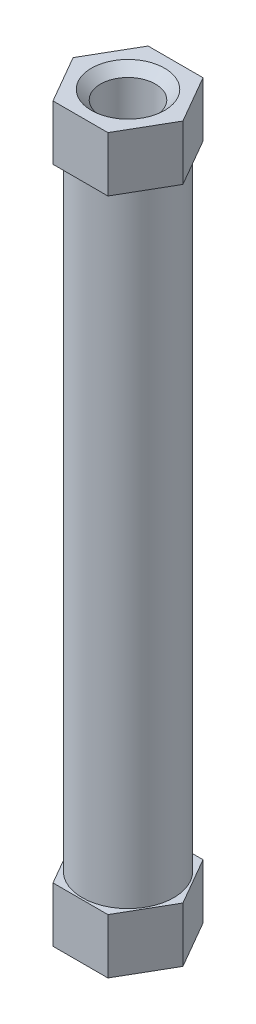
ISO-10303-21;
HEADER;
FILE_DESCRIPTION(('STEP AP214'),'2;1');
FILE_NAME('part.step','',(''),(''),'','','');
FILE_SCHEMA(('AUTOMOTIVE_DESIGN { 1 0 10303 214 1 1 1 1 }'));
ENDSEC;
DATA;
#1=APPLICATION_CONTEXT('core data for automotive mechanical design processes');
#2=APPLICATION_PROTOCOL_DEFINITION('international standard','automotive_design',2000,#1);
#3=PRODUCT_CONTEXT('',#1,'mechanical');
#4=PRODUCT('Part','Part','',(#3));
#5=PRODUCT_RELATED_PRODUCT_CATEGORY('part','',(#4));
#6=PRODUCT_DEFINITION_FORMATION('','',#4);
#7=PRODUCT_DEFINITION_CONTEXT('part definition',#1,'design');
#8=PRODUCT_DEFINITION('design','',#6,#7);
#9=PRODUCT_DEFINITION_SHAPE('','',#8);
#10=(LENGTH_UNIT() NAMED_UNIT(*) SI_UNIT(.MILLI.,.METRE.));
#11=(NAMED_UNIT(*) PLANE_ANGLE_UNIT() SI_UNIT($,.RADIAN.));
#12=(NAMED_UNIT(*) SI_UNIT($,.STERADIAN.) SOLID_ANGLE_UNIT());
#13=UNCERTAINTY_MEASURE_WITH_UNIT(LENGTH_MEASURE(1.E-05),#10,'distance_accuracy_value','');
#14=(GEOMETRIC_REPRESENTATION_CONTEXT(3) GLOBAL_UNCERTAINTY_ASSIGNED_CONTEXT((#13)) GLOBAL_UNIT_ASSIGNED_CONTEXT((#10,
#11,#12)) REPRESENTATION_CONTEXT('',''));
#15=CARTESIAN_POINT('',(0.,0.,0.));
#16=DIRECTION('',(0.,0.,1.));
#17=DIRECTION('',(1.,0.,0.));
#18=AXIS2_PLACEMENT_3D('',#15,#16,#17);
#19=CARTESIAN_POINT('',(-1.5,3.,2.59807621135332));
#20=DIRECTION('',(0.,0.,-1.));
#21=DIRECTION('',(-1.,0.,0.));
#22=AXIS2_PLACEMENT_3D('',#19,#20,#21);
#23=PLANE('',#22);
#24=DIRECTION('',(1.,0.,0.));
#25=VECTOR('',#24,1.);
#26=CARTESIAN_POINT('',(-1.5,0.,2.59807621135332));
#27=LINE('',#26,#25);
#28=CARTESIAN_POINT('',(-1.5,0.,2.59807621135332));
#29=VERTEX_POINT('',#28);
#30=CARTESIAN_POINT('',(1.5,0.,2.59807621135332));
#31=VERTEX_POINT('',#30);
#32=EDGE_CURVE('E143',#29,#31,#27,.T.);
#33=ORIENTED_EDGE('',*,*,#32,.T.);
#34=DIRECTION('',(0.,-1.,0.));
#35=VECTOR('',#34,1.);
#36=CARTESIAN_POINT('',(1.5,3.,2.59807621135332));
#37=LINE('',#36,#35);
#38=CARTESIAN_POINT('',(1.5,3.,2.59807621135332));
#39=VERTEX_POINT('',#38);
#40=EDGE_CURVE('E171',#39,#31,#37,.T.);
#41=ORIENTED_EDGE('',*,*,#40,.F.);
#42=DIRECTION('',(1.,0.,0.));
#43=VECTOR('',#42,1.);
#44=CARTESIAN_POINT('',(-1.5,3.,2.59807621135332));
#45=LINE('',#44,#43);
#46=CARTESIAN_POINT('',(-1.5,3.,2.59807621135332));
#47=VERTEX_POINT('',#46);
#48=EDGE_CURVE('E160',#47,#39,#45,.T.);
#49=ORIENTED_EDGE('',*,*,#48,.F.);
#50=DIRECTION('',(0.,-1.,0.));
#51=VECTOR('',#50,1.);
#52=CARTESIAN_POINT('',(-1.5,3.,2.59807621135332));
#53=LINE('',#52,#51);
#54=EDGE_CURVE('E139',#47,#29,#53,.T.);
#55=ORIENTED_EDGE('',*,*,#54,.T.);
#56=EDGE_LOOP('',(#33,#41,#49,#55));
#57=FACE_BOUND('',#56,.T.);
#58=ADVANCED_FACE('F47',(#57),#23,.F.);
#59=CARTESIAN_POINT('',(1.5,3.,2.59807621135332));
#60=DIRECTION('',(-0.866025403784439,0.,-0.5));
#61=DIRECTION('',(-0.5,0.,0.866025403784439));
#62=AXIS2_PLACEMENT_3D('',#59,#60,#61);
#63=PLANE('',#62);
#64=DIRECTION('',(0.5,0.,-0.866025403784439));
#65=VECTOR('',#64,1.);
#66=CARTESIAN_POINT('',(1.5,0.,2.59807621135332));
#67=LINE('',#66,#65);
#68=CARTESIAN_POINT('',(3.,0.,0.));
#69=VERTEX_POINT('',#68);
#70=EDGE_CURVE('E147',#31,#69,#67,.T.);
#71=ORIENTED_EDGE('',*,*,#70,.T.);
#72=DIRECTION('',(0.,-1.,0.));
#73=VECTOR('',#72,1.);
#74=CARTESIAN_POINT('',(3.,3.,0.));
#75=LINE('',#74,#73);
#76=CARTESIAN_POINT('',(3.,3.,0.));
#77=VERTEX_POINT('',#76);
#78=EDGE_CURVE('E167',#77,#69,#75,.T.);
#79=ORIENTED_EDGE('',*,*,#78,.F.);
#80=DIRECTION('',(0.5,0.,-0.866025403784439));
#81=VECTOR('',#80,1.);
#82=CARTESIAN_POINT('',(1.5,3.,2.59807621135332));
#83=LINE('',#82,#81);
#84=EDGE_CURVE('E105',#39,#77,#83,.T.);
#85=ORIENTED_EDGE('',*,*,#84,.F.);
#86=ORIENTED_EDGE('',*,*,#40,.T.);
#87=EDGE_LOOP('',(#71,#79,#85,#86));
#88=FACE_BOUND('',#87,.T.);
#89=ADVANCED_FACE('F215',(#88),#63,.F.);
#90=CARTESIAN_POINT('',(3.,3.,0.));
#91=DIRECTION('',(-0.866025403784438,0.,0.5));
#92=DIRECTION('',(0.5,0.,0.866025403784439));
#93=AXIS2_PLACEMENT_3D('',#90,#91,#92);
#94=PLANE('',#93);
#95=DIRECTION('',(-0.5,0.,-0.866025403784439));
#96=VECTOR('',#95,1.);
#97=CARTESIAN_POINT('',(3.,0.,0.));
#98=LINE('',#97,#96);
#99=CARTESIAN_POINT('',(1.5,0.,-2.59807621135332));
#100=VERTEX_POINT('',#99);
#101=EDGE_CURVE('E151',#69,#100,#98,.T.);
#102=ORIENTED_EDGE('',*,*,#101,.T.);
#103=DIRECTION('',(0.,-1.,0.));
#104=VECTOR('',#103,1.);
#105=CARTESIAN_POINT('',(1.5,3.,-2.59807621135332));
#106=LINE('',#105,#104);
#107=CARTESIAN_POINT('',(1.5,3.,-2.59807621135332));
#108=VERTEX_POINT('',#107);
#109=EDGE_CURVE('E132',#108,#100,#106,.T.);
#110=ORIENTED_EDGE('',*,*,#109,.F.);
#111=DIRECTION('',(-0.5,0.,-0.866025403784439));
#112=VECTOR('',#111,1.);
#113=CARTESIAN_POINT('',(3.,3.,0.));
#114=LINE('',#113,#112);
#115=EDGE_CURVE('E121',#77,#108,#114,.T.);
#116=ORIENTED_EDGE('',*,*,#115,.F.);
#117=ORIENTED_EDGE('',*,*,#78,.T.);
#118=EDGE_LOOP('',(#102,#110,#116,#117));
#119=FACE_BOUND('',#118,.T.);
#120=ADVANCED_FACE('F220',(#119),#94,.F.);
#121=CARTESIAN_POINT('',(1.5,3.,-2.59807621135332));
#122=DIRECTION('',(0.,0.,1.));
#123=DIRECTION('',(1.,0.,0.));
#124=AXIS2_PLACEMENT_3D('',#121,#122,#123);
#125=PLANE('',#124);
#126=DIRECTION('',(-1.,0.,0.));
#127=VECTOR('',#126,1.);
#128=CARTESIAN_POINT('',(1.5,0.,-2.59807621135332));
#129=LINE('',#128,#127);
#130=CARTESIAN_POINT('',(-1.5,0.,-2.59807621135332));
#131=VERTEX_POINT('',#130);
#132=EDGE_CURVE('E130',#100,#131,#129,.T.);
#133=ORIENTED_EDGE('',*,*,#132,.T.);
#134=DIRECTION('',(0.,-1.,0.));
#135=VECTOR('',#134,1.);
#136=CARTESIAN_POINT('',(-1.5,3.,-2.59807621135332));
#137=LINE('',#136,#135);
#138=CARTESIAN_POINT('',(-1.5,3.,-2.59807621135332));
#139=VERTEX_POINT('',#138);
#140=EDGE_CURVE('E127',#139,#131,#137,.T.);
#141=ORIENTED_EDGE('',*,*,#140,.F.);
#142=DIRECTION('',(-1.,0.,0.));
#143=VECTOR('',#142,1.);
#144=CARTESIAN_POINT('',(1.5,3.,-2.59807621135332));
#145=LINE('',#144,#143);
#146=EDGE_CURVE('E115',#108,#139,#145,.T.);
#147=ORIENTED_EDGE('',*,*,#146,.F.);
#148=ORIENTED_EDGE('',*,*,#109,.T.);
#149=EDGE_LOOP('',(#133,#141,#147,#148));
#150=FACE_BOUND('',#149,.T.);
#151=ADVANCED_FACE('F128',(#150),#125,.F.);
#152=CARTESIAN_POINT('',(-1.5,3.,-2.59807621135332));
#153=DIRECTION('',(0.866025403784439,0.,0.5));
#154=DIRECTION('',(0.5,0.,-0.866025403784439));
#155=AXIS2_PLACEMENT_3D('',#152,#153,#154);
#156=PLANE('',#155);
#157=DIRECTION('',(-0.5,0.,0.866025403784439));
#158=VECTOR('',#157,1.);
#159=CARTESIAN_POINT('',(-1.5,0.,-2.59807621135332));
#160=LINE('',#159,#158);
#161=CARTESIAN_POINT('',(-3.,0.,0.));
#162=VERTEX_POINT('',#161);
#163=EDGE_CURVE('E90',#131,#162,#160,.T.);
#164=ORIENTED_EDGE('',*,*,#163,.T.);
#165=DIRECTION('',(0.,-1.,0.));
#166=VECTOR('',#165,1.);
#167=CARTESIAN_POINT('',(-3.,3.,0.));
#168=LINE('',#167,#166);
#169=CARTESIAN_POINT('',(-3.,3.,0.));
#170=VERTEX_POINT('',#169);
#171=EDGE_CURVE('E133',#170,#162,#168,.T.);
#172=ORIENTED_EDGE('',*,*,#171,.F.);
#173=DIRECTION('',(-0.5,0.,0.866025403784439));
#174=VECTOR('',#173,1.);
#175=CARTESIAN_POINT('',(-1.5,3.,-2.59807621135332));
#176=LINE('',#175,#174);
#177=EDGE_CURVE('E119',#139,#170,#176,.T.);
#178=ORIENTED_EDGE('',*,*,#177,.F.);
#179=ORIENTED_EDGE('',*,*,#140,.T.);
#180=EDGE_LOOP('',(#164,#172,#178,#179));
#181=FACE_BOUND('',#180,.T.);
#182=ADVANCED_FACE('F135',(#181),#156,.F.);
#183=CARTESIAN_POINT('',(-3.,3.,0.));
#184=DIRECTION('',(0.866025403784438,0.,-0.500000000000001));
#185=DIRECTION('',(-0.500000000000001,0.,-0.866025403784438));
#186=AXIS2_PLACEMENT_3D('',#183,#184,#185);
#187=PLANE('',#186);
#188=DIRECTION('',(0.500000000000001,0.,0.866025403784438));
#189=VECTOR('',#188,1.);
#190=CARTESIAN_POINT('',(-3.,0.,0.));
#191=LINE('',#190,#189);
#192=EDGE_CURVE('E96',#162,#29,#191,.T.);
#193=ORIENTED_EDGE('',*,*,#192,.T.);
#194=ORIENTED_EDGE('',*,*,#54,.F.);
#195=DIRECTION('',(0.500000000000001,0.,0.866025403784438));
#196=VECTOR('',#195,1.);
#197=CARTESIAN_POINT('',(-3.,3.,0.));
#198=LINE('',#197,#196);
#199=EDGE_CURVE('E66',#170,#47,#198,.T.);
#200=ORIENTED_EDGE('',*,*,#199,.F.);
#201=ORIENTED_EDGE('',*,*,#171,.T.);
#202=EDGE_LOOP('',(#193,#194,#200,#201));
#203=FACE_BOUND('',#202,.T.);
#204=ADVANCED_FACE('F204',(#203),#187,.F.);
#205=CARTESIAN_POINT('',(0.,3.,0.));
#206=DIRECTION('',(0.,1.,0.));
#207=DIRECTION('',(0.,0.,1.));
#208=AXIS2_PLACEMENT_3D('',#205,#206,#207);
#209=PLANE('',#208);
#210=CARTESIAN_POINT('',(0.,3.,0.));
#211=DIRECTION('',(0.,1.,0.));
#212=DIRECTION('',(0.,0.,1.));
#213=AXIS2_PLACEMENT_3D('',#210,#211,#212);
#214=CIRCLE('',#213,2.5);
#215=CARTESIAN_POINT('',(0.,3.,2.5));
#216=VERTEX_POINT('',#215);
#217=EDGE_CURVE('E174',#216,#216,#214,.T.);
#218=ORIENTED_EDGE('',*,*,#217,.F.);
#219=EDGE_LOOP('',(#218));
#220=FACE_BOUND('',#219,.T.);
#221=ORIENTED_EDGE('',*,*,#48,.T.);
#222=ORIENTED_EDGE('',*,*,#84,.T.);
#223=ORIENTED_EDGE('',*,*,#115,.T.);
#224=ORIENTED_EDGE('',*,*,#146,.T.);
#225=ORIENTED_EDGE('',*,*,#177,.T.);
#226=ORIENTED_EDGE('',*,*,#199,.T.);
#227=EDGE_LOOP('',(#221,#222,#223,#224,#225,#226));
#228=FACE_BOUND('',#227,.T.);
#229=ADVANCED_FACE('F117',(#220,#228),#209,.T.);
#230=CARTESIAN_POINT('',(0.,0.,0.));
#231=DIRECTION('',(0.,1.,0.));
#232=DIRECTION('',(0.,0.,1.));
#233=AXIS2_PLACEMENT_3D('',#230,#231,#232);
#234=PLANE('',#233);
#235=CARTESIAN_POINT('',(0.,0.,0.));
#236=DIRECTION('',(0.,1.,0.));
#237=DIRECTION('',(0.,0.,1.));
#238=AXIS2_PLACEMENT_3D('',#235,#236,#237);
#239=CIRCLE('',#238,2.);
#240=CARTESIAN_POINT('',(0.,0.,2.));
#241=VERTEX_POINT('',#240);
#242=EDGE_CURVE('E175',#241,#241,#239,.T.);
#243=ORIENTED_EDGE('',*,*,#242,.T.);
#244=EDGE_LOOP('',(#243));
#245=FACE_BOUND('',#244,.T.);
#246=ORIENTED_EDGE('',*,*,#32,.F.);
#247=ORIENTED_EDGE('',*,*,#192,.F.);
#248=ORIENTED_EDGE('',*,*,#163,.F.);
#249=ORIENTED_EDGE('',*,*,#132,.F.);
#250=ORIENTED_EDGE('',*,*,#101,.F.);
#251=ORIENTED_EDGE('',*,*,#70,.F.);
#252=EDGE_LOOP('',(#246,#247,#248,#249,#250,#251));
#253=FACE_BOUND('',#252,.T.);
#254=ADVANCED_FACE('F194',(#245,#253),#234,.F.);
#255=CARTESIAN_POINT('',(0.,37.,0.));
#256=DIRECTION('',(0.,-1.,0.));
#257=DIRECTION('',(0.,0.,-1.));
#258=AXIS2_PLACEMENT_3D('',#255,#256,#257);
#259=CYLINDRICAL_SURFACE('',#258,2.5);
#260=CARTESIAN_POINT('',(0.,37.,0.));
#261=DIRECTION('',(0.,1.,0.));
#262=DIRECTION('',(0.,0.,1.));
#263=AXIS2_PLACEMENT_3D('',#260,#261,#262);
#264=CIRCLE('',#263,2.5);
#265=CARTESIAN_POINT('',(0.,37.,2.5));
#266=VERTEX_POINT('',#265);
#267=EDGE_CURVE('E148',#266,#266,#264,.T.);
#268=ORIENTED_EDGE('',*,*,#267,.F.);
#269=EDGE_LOOP('',(#268));
#270=FACE_BOUND('',#269,.T.);
#271=ORIENTED_EDGE('',*,*,#217,.T.);
#272=EDGE_LOOP('',(#271));
#273=FACE_BOUND('',#272,.T.);
#274=ADVANCED_FACE('F197',(#270,#273),#259,.T.);
#275=CARTESIAN_POINT('',(-1.5,40.,2.59807621135332));
#276=DIRECTION('',(0.,0.,-1.));
#277=DIRECTION('',(-1.,0.,0.));
#278=AXIS2_PLACEMENT_3D('',#275,#276,#277);
#279=PLANE('',#278);
#280=DIRECTION('',(1.,0.,0.));
#281=VECTOR('',#280,1.);
#282=CARTESIAN_POINT('',(-1.5,37.,2.59807621135332));
#283=LINE('',#282,#281);
#284=CARTESIAN_POINT('',(-1.5,37.,2.59807621135332));
#285=VERTEX_POINT('',#284);
#286=CARTESIAN_POINT('',(1.5,37.,2.59807621135332));
#287=VERTEX_POINT('',#286);
#288=EDGE_CURVE('E402',#285,#287,#283,.T.);
#289=ORIENTED_EDGE('',*,*,#288,.T.);
#290=DIRECTION('',(0.,-1.,0.));
#291=VECTOR('',#290,1.);
#292=CARTESIAN_POINT('',(1.5,40.,2.59807621135332));
#293=LINE('',#292,#291);
#294=CARTESIAN_POINT('',(1.5,40.,2.59807621135332));
#295=VERTEX_POINT('',#294);
#296=EDGE_CURVE('E399',#295,#287,#293,.T.);
#297=ORIENTED_EDGE('',*,*,#296,.F.);
#298=DIRECTION('',(1.,0.,0.));
#299=VECTOR('',#298,1.);
#300=CARTESIAN_POINT('',(-1.5,40.,2.59807621135332));
#301=LINE('',#300,#299);
#302=CARTESIAN_POINT('',(-1.5,40.,2.59807621135332));
#303=VERTEX_POINT('',#302);
#304=EDGE_CURVE('E381',#303,#295,#301,.T.);
#305=ORIENTED_EDGE('',*,*,#304,.F.);
#306=DIRECTION('',(0.,-1.,0.));
#307=VECTOR('',#306,1.);
#308=CARTESIAN_POINT('',(-1.5,40.,2.59807621135332));
#309=LINE('',#308,#307);
#310=EDGE_CURVE('E436',#303,#285,#309,.T.);
#311=ORIENTED_EDGE('',*,*,#310,.T.);
#312=EDGE_LOOP('',(#289,#297,#305,#311));
#313=FACE_BOUND('',#312,.T.);
#314=ADVANCED_FACE('F269',(#313),#279,.F.);
#315=CARTESIAN_POINT('',(1.5,40.,2.59807621135332));
#316=DIRECTION('',(-0.866025403784439,0.,-0.5));
#317=DIRECTION('',(-0.5,0.,0.866025403784439));
#318=AXIS2_PLACEMENT_3D('',#315,#316,#317);
#319=PLANE('',#318);
#320=DIRECTION('',(0.5,0.,-0.866025403784439));
#321=VECTOR('',#320,1.);
#322=CARTESIAN_POINT('',(1.5,37.,2.59807621135332));
#323=LINE('',#322,#321);
#324=CARTESIAN_POINT('',(3.,37.,0.));
#325=VERTEX_POINT('',#324);
#326=EDGE_CURVE('E454',#287,#325,#323,.T.);
#327=ORIENTED_EDGE('',*,*,#326,.T.);
#328=DIRECTION('',(0.,-1.,0.));
#329=VECTOR('',#328,1.);
#330=CARTESIAN_POINT('',(3.,40.,0.));
#331=LINE('',#330,#329);
#332=CARTESIAN_POINT('',(3.,40.,0.));
#333=VERTEX_POINT('',#332);
#334=EDGE_CURVE('E405',#333,#325,#331,.T.);
#335=ORIENTED_EDGE('',*,*,#334,.F.);
#336=DIRECTION('',(0.5,0.,-0.866025403784439));
#337=VECTOR('',#336,1.);
#338=CARTESIAN_POINT('',(1.5,40.,2.59807621135332));
#339=LINE('',#338,#337);
#340=EDGE_CURVE('E386',#295,#333,#339,.T.);
#341=ORIENTED_EDGE('',*,*,#340,.F.);
#342=ORIENTED_EDGE('',*,*,#296,.T.);
#343=EDGE_LOOP('',(#327,#335,#341,#342));
#344=FACE_BOUND('',#343,.T.);
#345=ADVANCED_FACE('F279',(#344),#319,.F.);
#346=CARTESIAN_POINT('',(3.,40.,0.));
#347=DIRECTION('',(-0.866025403784438,0.,0.5));
#348=DIRECTION('',(0.5,0.,0.866025403784438));
#349=AXIS2_PLACEMENT_3D('',#346,#347,#348);
#350=PLANE('',#349);
#351=DIRECTION('',(-0.5,0.,-0.866025403784438));
#352=VECTOR('',#351,1.);
#353=CARTESIAN_POINT('',(3.,37.,0.));
#354=LINE('',#353,#352);
#355=CARTESIAN_POINT('',(1.5,37.,-2.59807621135332));
#356=VERTEX_POINT('',#355);
#357=EDGE_CURVE('E450',#325,#356,#354,.T.);
#358=ORIENTED_EDGE('',*,*,#357,.T.);
#359=DIRECTION('',(0.,-1.,0.));
#360=VECTOR('',#359,1.);
#361=CARTESIAN_POINT('',(1.5,40.,-2.59807621135332));
#362=LINE('',#361,#360);
#363=CARTESIAN_POINT('',(1.5,40.,-2.59807621135332));
#364=VERTEX_POINT('',#363);
#365=EDGE_CURVE('E412',#364,#356,#362,.T.);
#366=ORIENTED_EDGE('',*,*,#365,.F.);
#367=DIRECTION('',(-0.5,0.,-0.866025403784438));
#368=VECTOR('',#367,1.);
#369=CARTESIAN_POINT('',(3.,40.,0.));
#370=LINE('',#369,#368);
#371=EDGE_CURVE('E468',#333,#364,#370,.T.);
#372=ORIENTED_EDGE('',*,*,#371,.F.);
#373=ORIENTED_EDGE('',*,*,#334,.T.);
#374=EDGE_LOOP('',(#358,#366,#372,#373));
#375=FACE_BOUND('',#374,.T.);
#376=ADVANCED_FACE('F289',(#375),#350,.F.);
#377=CARTESIAN_POINT('',(1.5,40.,-2.59807621135332));
#378=DIRECTION('',(0.,0.,1.));
#379=DIRECTION('',(1.,0.,0.));
#380=AXIS2_PLACEMENT_3D('',#377,#378,#379);
#381=PLANE('',#380);
#382=DIRECTION('',(-1.,0.,0.));
#383=VECTOR('',#382,1.);
#384=CARTESIAN_POINT('',(1.5,37.,-2.59807621135332));
#385=LINE('',#384,#383);
#386=CARTESIAN_POINT('',(-1.5,37.,-2.59807621135332));
#387=VERTEX_POINT('',#386);
#388=EDGE_CURVE('E446',#356,#387,#385,.T.);
#389=ORIENTED_EDGE('',*,*,#388,.T.);
#390=DIRECTION('',(0.,-1.,0.));
#391=VECTOR('',#390,1.);
#392=CARTESIAN_POINT('',(-1.5,40.,-2.59807621135332));
#393=LINE('',#392,#391);
#394=CARTESIAN_POINT('',(-1.5,40.,-2.59807621135332));
#395=VERTEX_POINT('',#394);
#396=EDGE_CURVE('E428',#395,#387,#393,.T.);
#397=ORIENTED_EDGE('',*,*,#396,.F.);
#398=DIRECTION('',(-1.,0.,0.));
#399=VECTOR('',#398,1.);
#400=CARTESIAN_POINT('',(1.5,40.,-2.59807621135332));
#401=LINE('',#400,#399);
#402=EDGE_CURVE('E464',#364,#395,#401,.T.);
#403=ORIENTED_EDGE('',*,*,#402,.F.);
#404=ORIENTED_EDGE('',*,*,#365,.T.);
#405=EDGE_LOOP('',(#389,#397,#403,#404));
#406=FACE_BOUND('',#405,.T.);
#407=ADVANCED_FACE('F299',(#406),#381,.F.);
#408=CARTESIAN_POINT('',(-1.5,40.,-2.59807621135332));
#409=DIRECTION('',(0.866025403784439,0.,0.5));
#410=DIRECTION('',(0.5,0.,-0.866025403784439));
#411=AXIS2_PLACEMENT_3D('',#408,#409,#410);
#412=PLANE('',#411);
#413=DIRECTION('',(-0.5,0.,0.866025403784439));
#414=VECTOR('',#413,1.);
#415=CARTESIAN_POINT('',(-1.5,37.,-2.59807621135332));
#416=LINE('',#415,#414);
#417=CARTESIAN_POINT('',(-3.00000000000001,37.,0.));
#418=VERTEX_POINT('',#417);
#419=EDGE_CURVE('E442',#387,#418,#416,.T.);
#420=ORIENTED_EDGE('',*,*,#419,.T.);
#421=DIRECTION('',(0.,-1.,0.));
#422=VECTOR('',#421,1.);
#423=CARTESIAN_POINT('',(-3.00000000000001,40.,0.));
#424=LINE('',#423,#422);
#425=CARTESIAN_POINT('',(-3.00000000000001,40.,0.));
#426=VERTEX_POINT('',#425);
#427=EDGE_CURVE('E432',#426,#418,#424,.T.);
#428=ORIENTED_EDGE('',*,*,#427,.F.);
#429=DIRECTION('',(-0.5,0.,0.866025403784439));
#430=VECTOR('',#429,1.);
#431=CARTESIAN_POINT('',(-1.5,40.,-2.59807621135332));
#432=LINE('',#431,#430);
#433=EDGE_CURVE('E461',#395,#426,#432,.T.);
#434=ORIENTED_EDGE('',*,*,#433,.F.);
#435=ORIENTED_EDGE('',*,*,#396,.T.);
#436=EDGE_LOOP('',(#420,#428,#434,#435));
#437=FACE_BOUND('',#436,.T.);
#438=ADVANCED_FACE('F309',(#437),#412,.F.);
#439=CARTESIAN_POINT('',(-3.00000000000001,40.,0.));
#440=DIRECTION('',(0.866025403784438,0.,-0.5));
#441=DIRECTION('',(-0.5,0.,-0.866025403784439));
#442=AXIS2_PLACEMENT_3D('',#439,#440,#441);
#443=PLANE('',#442);
#444=DIRECTION('',(0.5,0.,0.866025403784439));
#445=VECTOR('',#444,1.);
#446=CARTESIAN_POINT('',(-3.00000000000001,37.,0.));
#447=LINE('',#446,#445);
#448=EDGE_CURVE('E395',#418,#285,#447,.T.);
#449=ORIENTED_EDGE('',*,*,#448,.T.);
#450=ORIENTED_EDGE('',*,*,#310,.F.);
#451=DIRECTION('',(0.5,0.,0.866025403784439));
#452=VECTOR('',#451,1.);
#453=CARTESIAN_POINT('',(-3.00000000000001,40.,0.));
#454=LINE('',#453,#452);
#455=EDGE_CURVE('E390',#426,#303,#454,.T.);
#456=ORIENTED_EDGE('',*,*,#455,.F.);
#457=ORIENTED_EDGE('',*,*,#427,.T.);
#458=EDGE_LOOP('',(#449,#450,#456,#457));
#459=FACE_BOUND('',#458,.T.);
#460=ADVANCED_FACE('F319',(#459),#443,.F.);
#461=CARTESIAN_POINT('',(0.,40.,0.));
#462=DIRECTION('',(0.,1.,0.));
#463=DIRECTION('',(0.,0.,1.));
#464=AXIS2_PLACEMENT_3D('',#461,#462,#463);
#465=PLANE('',#464);
#466=CARTESIAN_POINT('',(0.,40.,0.));
#467=DIRECTION('',(0.,1.,0.));
#468=DIRECTION('',(0.,0.,1.));
#469=AXIS2_PLACEMENT_3D('',#466,#467,#468);
#470=CIRCLE('',#469,1.99999999999999);
#471=CARTESIAN_POINT('',(0.,40.,1.99999999999999));
#472=VERTEX_POINT('',#471);
#473=EDGE_CURVE('E11',#472,#472,#470,.F.);
#474=ORIENTED_EDGE('',*,*,#473,.T.);
#475=EDGE_LOOP('',(#474));
#476=FACE_BOUND('',#475,.T.);
#477=ORIENTED_EDGE('',*,*,#304,.T.);
#478=ORIENTED_EDGE('',*,*,#340,.T.);
#479=ORIENTED_EDGE('',*,*,#371,.T.);
#480=ORIENTED_EDGE('',*,*,#402,.T.);
#481=ORIENTED_EDGE('',*,*,#433,.T.);
#482=ORIENTED_EDGE('',*,*,#455,.T.);
#483=EDGE_LOOP('',(#477,#478,#479,#480,#481,#482));
#484=FACE_BOUND('',#483,.T.);
#485=ADVANCED_FACE('F329',(#476,#484),#465,.T.);
#486=CARTESIAN_POINT('',(0.,37.,0.));
#487=DIRECTION('',(0.,1.,0.));
#488=DIRECTION('',(0.,0.,1.));
#489=AXIS2_PLACEMENT_3D('',#486,#487,#488);
#490=PLANE('',#489);
#491=ORIENTED_EDGE('',*,*,#267,.T.);
#492=EDGE_LOOP('',(#491));
#493=FACE_BOUND('',#492,.T.);
#494=ORIENTED_EDGE('',*,*,#288,.F.);
#495=ORIENTED_EDGE('',*,*,#448,.F.);
#496=ORIENTED_EDGE('',*,*,#419,.F.);
#497=ORIENTED_EDGE('',*,*,#388,.F.);
#498=ORIENTED_EDGE('',*,*,#357,.F.);
#499=ORIENTED_EDGE('',*,*,#326,.F.);
#500=EDGE_LOOP('',(#494,#495,#496,#497,#498,#499));
#501=FACE_BOUND('',#500,.T.);
#502=ADVANCED_FACE('F338',(#493,#501),#490,.F.);
#503=CARTESIAN_POINT('',(0.,0.,0.));
#504=DIRECTION('',(0.,1.,0.));
#505=DIRECTION('',(0.,0.,1.));
#506=AXIS2_PLACEMENT_3D('',#503,#504,#505);
#507=CYLINDRICAL_SURFACE('',#506,1.5);
#508=CARTESIAN_POINT('',(0.,0.500000000000007,0.));
#509=DIRECTION('',(0.,1.,0.));
#510=DIRECTION('',(0.,0.,1.));
#511=AXIS2_PLACEMENT_3D('',#508,#509,#510);
#512=CIRCLE('',#511,1.5);
#513=CARTESIAN_POINT('',(0.,0.500000000000007,1.5));
#514=VERTEX_POINT('',#513);
#515=EDGE_CURVE('E58',#514,#514,#512,.F.);
#516=ORIENTED_EDGE('',*,*,#515,.T.);
#517=EDGE_LOOP('',(#516));
#518=FACE_BOUND('',#517,.T.);
#519=CARTESIAN_POINT('',(0.,39.5,0.));
#520=DIRECTION('',(0.,1.,0.));
#521=DIRECTION('',(0.,0.,1.));
#522=AXIS2_PLACEMENT_3D('',#519,#520,#521);
#523=CIRCLE('',#522,1.5);
#524=CARTESIAN_POINT('',(0.,39.5,1.5));
#525=VERTEX_POINT('',#524);
#526=EDGE_CURVE('E179',#525,#525,#523,.T.);
#527=ORIENTED_EDGE('',*,*,#526,.T.);
#528=EDGE_LOOP('',(#527));
#529=FACE_BOUND('',#528,.T.);
#530=ADVANCED_FACE('F186',(#518,#529),#507,.F.);
#531=CARTESIAN_POINT('',(0.,0.,0.));
#532=DIRECTION('',(0.,-1.,0.));
#533=DIRECTION('',(0.,0.,-1.));
#534=AXIS2_PLACEMENT_3D('',#531,#532,#533);
#535=CONICAL_SURFACE('',#534,2.,0.785398163397443);
#536=ORIENTED_EDGE('',*,*,#515,.F.);
#537=EDGE_LOOP('',(#536));
#538=FACE_BOUND('',#537,.T.);
#539=ORIENTED_EDGE('',*,*,#242,.F.);
#540=EDGE_LOOP('',(#539));
#541=FACE_BOUND('',#540,.T.);
#542=ADVANCED_FACE('F189',(#538,#541),#535,.F.);
#543=CARTESIAN_POINT('',(0.,39.5,0.));
#544=DIRECTION('',(0.,1.,0.));
#545=DIRECTION('',(0.,0.,1.));
#546=AXIS2_PLACEMENT_3D('',#543,#544,#545);
#547=CONICAL_SURFACE('',#546,1.5,0.785398163397449);
#548=ORIENTED_EDGE('',*,*,#473,.F.);
#549=EDGE_LOOP('',(#548));
#550=FACE_BOUND('',#549,.T.);
#551=ORIENTED_EDGE('',*,*,#526,.F.);
#552=EDGE_LOOP('',(#551));
#553=FACE_BOUND('',#552,.T.);
#554=ADVANCED_FACE('F50',(#550,#553),#547,.F.);
#555=CLOSED_SHELL('',(#58,#89,#120,#151,#182,#204,#229,#254,#274,#314,#345,#376,#407,#438,#460,
#485,#502,#530,#542,#554));
#556=MANIFOLD_SOLID_BREP('B2',#555);
#557=ADVANCED_BREP_SHAPE_REPRESENTATION('',(#18,#556),#14);
#558=SHAPE_DEFINITION_REPRESENTATION(#9,#557);
ENDSEC;
END-ISO-10303-21;
